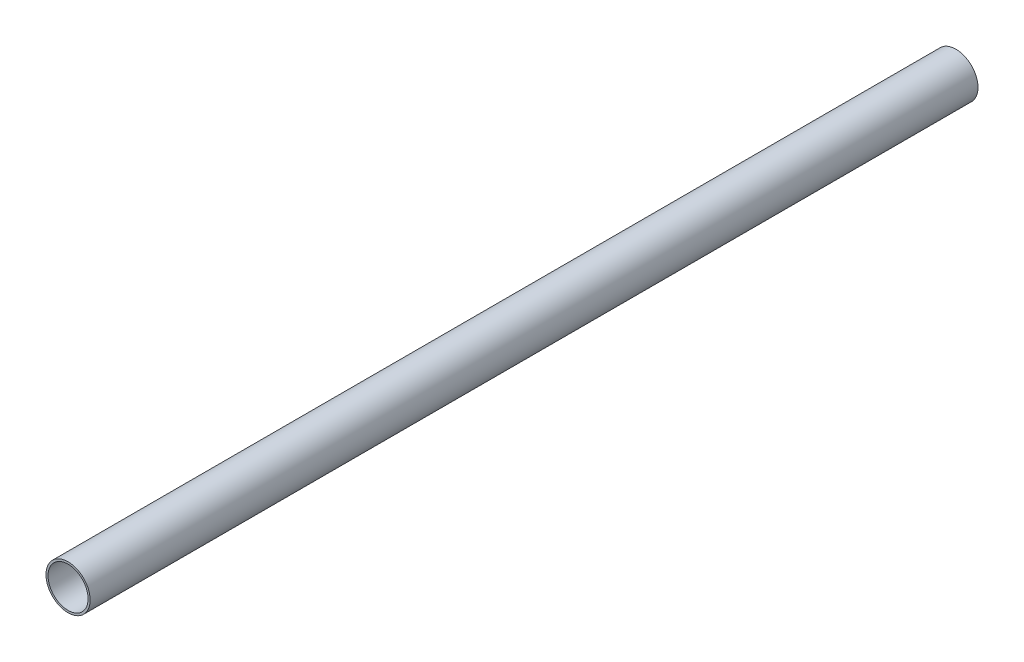
ISO-10303-21;
HEADER;
FILE_DESCRIPTION(('STEP AP214'),'2;1');
FILE_NAME('part.step','',(''),(''),'','','');
FILE_SCHEMA(('AUTOMOTIVE_DESIGN { 1 0 10303 214 1 1 1 1 }'));
ENDSEC;
DATA;
#1=APPLICATION_CONTEXT('core data for automotive mechanical design processes');
#2=APPLICATION_PROTOCOL_DEFINITION('international standard','automotive_design',2000,#1);
#3=PRODUCT_CONTEXT('',#1,'mechanical');
#4=PRODUCT('Part','Part','',(#3));
#5=PRODUCT_RELATED_PRODUCT_CATEGORY('part','',(#4));
#6=PRODUCT_DEFINITION_FORMATION('','',#4);
#7=PRODUCT_DEFINITION_CONTEXT('part definition',#1,'design');
#8=PRODUCT_DEFINITION('design','',#6,#7);
#9=PRODUCT_DEFINITION_SHAPE('','',#8);
#10=(LENGTH_UNIT() NAMED_UNIT(*) SI_UNIT(.MILLI.,.METRE.));
#11=(NAMED_UNIT(*) PLANE_ANGLE_UNIT() SI_UNIT($,.RADIAN.));
#12=(NAMED_UNIT(*) SI_UNIT($,.STERADIAN.) SOLID_ANGLE_UNIT());
#13=UNCERTAINTY_MEASURE_WITH_UNIT(LENGTH_MEASURE(1.E-05),#10,'distance_accuracy_value','');
#14=(GEOMETRIC_REPRESENTATION_CONTEXT(3) GLOBAL_UNCERTAINTY_ASSIGNED_CONTEXT((#13)) GLOBAL_UNIT_ASSIGNED_CONTEXT((#10,
#11,#12)) REPRESENTATION_CONTEXT('',''));
#15=CARTESIAN_POINT('',(0.,0.,0.));
#16=DIRECTION('',(0.,0.,1.));
#17=DIRECTION('',(1.,0.,0.));
#18=AXIS2_PLACEMENT_3D('',#15,#16,#17);
#19=CARTESIAN_POINT('',(0.,0.,5486.4));
#20=DIRECTION('',(0.,0.,1.));
#21=DIRECTION('',(1.,0.,0.));
#22=AXIS2_PLACEMENT_3D('',#19,#20,#21);
#23=PLANE('',#22);
#24=CARTESIAN_POINT('',(0.,0.,5486.4));
#25=DIRECTION('',(0.,0.,1.));
#26=DIRECTION('',(1.,0.,0.));
#27=AXIS2_PLACEMENT_3D('',#24,#25,#26);
#28=CIRCLE('',#27,136.525);
#29=CARTESIAN_POINT('',(136.525,0.,5486.4));
#30=VERTEX_POINT('',#29);
#31=EDGE_CURVE('E10',#30,#30,#28,.T.);
#32=ORIENTED_EDGE('',*,*,#31,.T.);
#33=EDGE_LOOP('',(#32));
#34=FACE_BOUND('',#33,.T.);
#35=CARTESIAN_POINT('',(0.,0.,5486.4));
#36=DIRECTION('',(0.,0.,1.));
#37=DIRECTION('',(1.,0.,0.));
#38=AXIS2_PLACEMENT_3D('',#35,#36,#37);
#39=CIRCLE('',#38,123.825);
#40=CARTESIAN_POINT('',(123.825,0.,5486.4));
#41=VERTEX_POINT('',#40);
#42=EDGE_CURVE('E39',#41,#41,#39,.T.);
#43=ORIENTED_EDGE('',*,*,#42,.F.);
#44=EDGE_LOOP('',(#43));
#45=FACE_BOUND('',#44,.T.);
#46=ADVANCED_FACE('F28',(#34,#45),#23,.T.);
#47=CARTESIAN_POINT('',(0.,0.,0.));
#48=DIRECTION('',(0.,0.,1.));
#49=DIRECTION('',(1.,0.,0.));
#50=AXIS2_PLACEMENT_3D('',#47,#48,#49);
#51=PLANE('',#50);
#52=CARTESIAN_POINT('',(0.,0.,0.));
#53=DIRECTION('',(0.,0.,1.));
#54=DIRECTION('',(1.,0.,0.));
#55=AXIS2_PLACEMENT_3D('',#52,#53,#54);
#56=CIRCLE('',#55,136.525);
#57=CARTESIAN_POINT('',(136.525,0.,0.));
#58=VERTEX_POINT('',#57);
#59=EDGE_CURVE('E32',#58,#58,#56,.T.);
#60=ORIENTED_EDGE('',*,*,#59,.F.);
#61=EDGE_LOOP('',(#60));
#62=FACE_BOUND('',#61,.T.);
#63=CARTESIAN_POINT('',(0.,0.,0.));
#64=DIRECTION('',(0.,0.,1.));
#65=DIRECTION('',(1.,0.,0.));
#66=AXIS2_PLACEMENT_3D('',#63,#64,#65);
#67=CIRCLE('',#66,123.825);
#68=CARTESIAN_POINT('',(123.825,0.,0.));
#69=VERTEX_POINT('',#68);
#70=EDGE_CURVE('E41',#69,#69,#67,.T.);
#71=ORIENTED_EDGE('',*,*,#70,.T.);
#72=EDGE_LOOP('',(#71));
#73=FACE_BOUND('',#72,.T.);
#74=ADVANCED_FACE('F51',(#62,#73),#51,.F.);
#75=CARTESIAN_POINT('',(0.,0.,5486.4));
#76=DIRECTION('',(0.,0.,-1.));
#77=DIRECTION('',(-1.,0.,0.));
#78=AXIS2_PLACEMENT_3D('',#75,#76,#77);
#79=CYLINDRICAL_SURFACE('',#78,136.525);
#80=ORIENTED_EDGE('',*,*,#31,.F.);
#81=EDGE_LOOP('',(#80));
#82=FACE_BOUND('',#81,.T.);
#83=ORIENTED_EDGE('',*,*,#59,.T.);
#84=EDGE_LOOP('',(#83));
#85=FACE_BOUND('',#84,.T.);
#86=ADVANCED_FACE('F30',(#82,#85),#79,.T.);
#87=CARTESIAN_POINT('',(0.,0.,5486.4));
#88=DIRECTION('',(0.,0.,-1.));
#89=DIRECTION('',(-1.,0.,0.));
#90=AXIS2_PLACEMENT_3D('',#87,#88,#89);
#91=CYLINDRICAL_SURFACE('',#90,123.825);
#92=ORIENTED_EDGE('',*,*,#42,.T.);
#93=EDGE_LOOP('',(#92));
#94=FACE_BOUND('',#93,.T.);
#95=ORIENTED_EDGE('',*,*,#70,.F.);
#96=EDGE_LOOP('',(#95));
#97=FACE_BOUND('',#96,.T.);
#98=ADVANCED_FACE('F47',(#94,#97),#91,.F.);
#99=CLOSED_SHELL('',(#46,#74,#86,#98));
#100=MANIFOLD_SOLID_BREP('B2',#99);
#101=ADVANCED_BREP_SHAPE_REPRESENTATION('',(#18,#100),#14);
#102=SHAPE_DEFINITION_REPRESENTATION(#9,#101);
ENDSEC;
END-ISO-10303-21;
